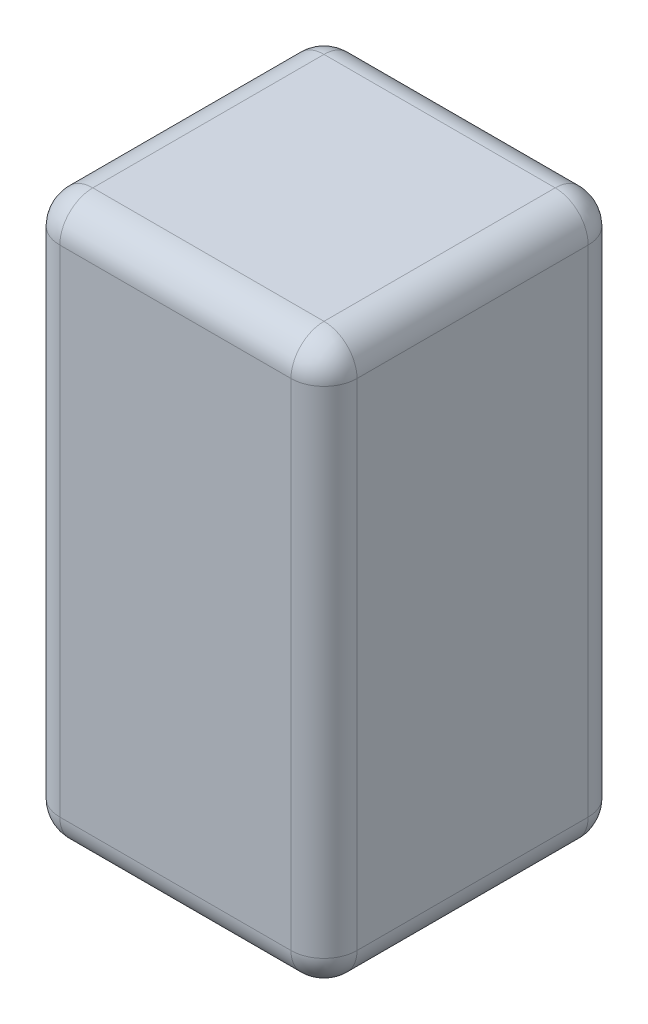
ISO-10303-21;
HEADER;
FILE_DESCRIPTION(('STEP AP214'),'2;1');
FILE_NAME('part.step','',(''),(''),'','','');
FILE_SCHEMA(('AUTOMOTIVE_DESIGN { 1 0 10303 214 1 1 1 1 }'));
ENDSEC;
DATA;
#1=APPLICATION_CONTEXT('core data for automotive mechanical design processes');
#2=APPLICATION_PROTOCOL_DEFINITION('international standard','automotive_design',2000,#1);
#3=PRODUCT_CONTEXT('',#1,'mechanical');
#4=PRODUCT('Part','Part','',(#3));
#5=PRODUCT_RELATED_PRODUCT_CATEGORY('part','',(#4));
#6=PRODUCT_DEFINITION_FORMATION('','',#4);
#7=PRODUCT_DEFINITION_CONTEXT('part definition',#1,'design');
#8=PRODUCT_DEFINITION('design','',#6,#7);
#9=PRODUCT_DEFINITION_SHAPE('','',#8);
#10=(LENGTH_UNIT() NAMED_UNIT(*) SI_UNIT(.MILLI.,.METRE.));
#11=(NAMED_UNIT(*) PLANE_ANGLE_UNIT() SI_UNIT($,.RADIAN.));
#12=(NAMED_UNIT(*) SI_UNIT($,.STERADIAN.) SOLID_ANGLE_UNIT());
#13=UNCERTAINTY_MEASURE_WITH_UNIT(LENGTH_MEASURE(1.E-05),#10,'distance_accuracy_value','');
#14=(GEOMETRIC_REPRESENTATION_CONTEXT(3) GLOBAL_UNCERTAINTY_ASSIGNED_CONTEXT((#13)) GLOBAL_UNIT_ASSIGNED_CONTEXT((#10,
#11,#12)) REPRESENTATION_CONTEXT('',''));
#15=CARTESIAN_POINT('',(0.,0.,0.));
#16=DIRECTION('',(0.,0.,1.));
#17=DIRECTION('',(1.,0.,0.));
#18=AXIS2_PLACEMENT_3D('',#15,#16,#17);
#19=CARTESIAN_POINT('',(-14.85,-8.85,-0.8));
#20=DIRECTION('',(-1.,0.,0.));
#21=DIRECTION('',(0.,1.,0.));
#22=AXIS2_PLACEMENT_3D('',#19,#20,#21);
#23=SPHERICAL_SURFACE('',#22,0.1);
#24=CARTESIAN_POINT('',(-14.85,-8.85,-0.8));
#25=DIRECTION('',(0.,-1.,0.));
#26=DIRECTION('',(1.,0.,0.));
#27=AXIS2_PLACEMENT_3D('',#24,#25,#26);
#28=CIRCLE('',#27,0.1);
#29=CARTESIAN_POINT('',(-14.95,-8.85,-0.8));
#30=VERTEX_POINT('',#29);
#31=CARTESIAN_POINT('',(-14.85,-8.85,-0.9));
#32=VERTEX_POINT('',#31);
#33=EDGE_CURVE('E120',#30,#32,#28,.T.);
#34=ORIENTED_EDGE('',*,*,#33,.F.);
#35=CARTESIAN_POINT('',(-14.85,-8.85,-0.8));
#36=DIRECTION('',(0.,0.,-1.));
#37=DIRECTION('',(-1.,0.,0.));
#38=AXIS2_PLACEMENT_3D('',#35,#36,#37);
#39=CIRCLE('',#38,0.1);
#40=CARTESIAN_POINT('',(-14.85,-8.75,-0.8));
#41=VERTEX_POINT('',#40);
#42=EDGE_CURVE('E122',#41,#30,#39,.F.);
#43=ORIENTED_EDGE('',*,*,#42,.F.);
#44=CARTESIAN_POINT('',(-14.85,-8.85,-0.8));
#45=DIRECTION('',(-1.,0.,0.));
#46=DIRECTION('',(0.,-1.,0.));
#47=AXIS2_PLACEMENT_3D('',#44,#45,#46);
#48=CIRCLE('',#47,0.1);
#49=EDGE_CURVE('E119',#32,#41,#48,.F.);
#50=ORIENTED_EDGE('',*,*,#49,.F.);
#51=EDGE_LOOP('',(#34,#43,#50));
#52=FACE_BOUND('',#51,.T.);
#53=ADVANCED_FACE('F17',(#52),#23,.T.);
#54=CARTESIAN_POINT('',(-14.85,-8.85,-0.1));
#55=DIRECTION('',(0.,1.,0.));
#56=DIRECTION('',(-1.,0.,0.));
#57=AXIS2_PLACEMENT_3D('',#54,#55,#56);
#58=SPHERICAL_SURFACE('',#57,0.1);
#59=CARTESIAN_POINT('',(-14.85,-8.85,-0.1));
#60=DIRECTION('',(0.,1.,0.));
#61=DIRECTION('',(-1.,0.,0.));
#62=AXIS2_PLACEMENT_3D('',#59,#60,#61);
#63=CIRCLE('',#62,0.1);
#64=CARTESIAN_POINT('',(-14.85,-8.85,0.));
#65=VERTEX_POINT('',#64);
#66=CARTESIAN_POINT('',(-14.95,-8.85,-0.1));
#67=VERTEX_POINT('',#66);
#68=EDGE_CURVE('E177',#65,#67,#63,.F.);
#69=ORIENTED_EDGE('',*,*,#68,.F.);
#70=CARTESIAN_POINT('',(-14.85,-8.85,-0.1));
#71=DIRECTION('',(-1.,0.,0.));
#72=DIRECTION('',(0.,-1.,0.));
#73=AXIS2_PLACEMENT_3D('',#70,#71,#72);
#74=CIRCLE('',#73,0.1);
#75=CARTESIAN_POINT('',(-14.85,-8.75,-0.1));
#76=VERTEX_POINT('',#75);
#77=EDGE_CURVE('E182',#76,#65,#74,.F.);
#78=ORIENTED_EDGE('',*,*,#77,.F.);
#79=CARTESIAN_POINT('',(-14.85,-8.85,-0.1));
#80=DIRECTION('',(0.,0.,-1.));
#81=DIRECTION('',(-1.,0.,0.));
#82=AXIS2_PLACEMENT_3D('',#79,#80,#81);
#83=CIRCLE('',#82,0.1);
#84=EDGE_CURVE('E187',#67,#76,#83,.T.);
#85=ORIENTED_EDGE('',*,*,#84,.F.);
#86=EDGE_LOOP('',(#69,#78,#85));
#87=FACE_BOUND('',#86,.T.);
#88=ADVANCED_FACE('F221',(#87),#58,.T.);
#89=CARTESIAN_POINT('',(-14.85,-10.35,-0.1));
#90=DIRECTION('',(-1.,0.,0.));
#91=DIRECTION('',(0.,-1.,0.));
#92=AXIS2_PLACEMENT_3D('',#89,#90,#91);
#93=SPHERICAL_SURFACE('',#92,0.1);
#94=CARTESIAN_POINT('',(-14.85,-10.35,-0.1));
#95=DIRECTION('',(0.,0.,1.));
#96=DIRECTION('',(0.,-1.,0.));
#97=AXIS2_PLACEMENT_3D('',#94,#95,#96);
#98=CIRCLE('',#97,0.1);
#99=CARTESIAN_POINT('',(-14.85,-10.45,-0.1));
#100=VERTEX_POINT('',#99);
#101=CARTESIAN_POINT('',(-14.95,-10.35,-0.0999999999999999));
#102=VERTEX_POINT('',#101);
#103=EDGE_CURVE('E166',#100,#102,#98,.F.);
#104=ORIENTED_EDGE('',*,*,#103,.F.);
#105=CARTESIAN_POINT('',(-14.85,-10.35,-0.1));
#106=DIRECTION('',(-1.,0.,0.));
#107=DIRECTION('',(0.,-1.,0.));
#108=AXIS2_PLACEMENT_3D('',#105,#106,#107);
#109=CIRCLE('',#108,0.1);
#110=CARTESIAN_POINT('',(-14.85,-10.35,0.));
#111=VERTEX_POINT('',#110);
#112=EDGE_CURVE('E152',#111,#100,#109,.F.);
#113=ORIENTED_EDGE('',*,*,#112,.F.);
#114=CARTESIAN_POINT('',(-14.85,-10.35,-0.0999999999999999));
#115=DIRECTION('',(0.,1.,0.));
#116=DIRECTION('',(-1.,0.,0.));
#117=AXIS2_PLACEMENT_3D('',#114,#115,#116);
#118=CIRCLE('',#117,0.1);
#119=EDGE_CURVE('E156',#102,#111,#118,.T.);
#120=ORIENTED_EDGE('',*,*,#119,.F.);
#121=EDGE_LOOP('',(#104,#113,#120));
#122=FACE_BOUND('',#121,.T.);
#123=ADVANCED_FACE('F216',(#122),#93,.T.);
#124=CARTESIAN_POINT('',(-14.85,-10.35,-0.8));
#125=DIRECTION('',(0.,-1.,0.));
#126=DIRECTION('',(-1.,0.,0.));
#127=AXIS2_PLACEMENT_3D('',#124,#125,#126);
#128=SPHERICAL_SURFACE('',#127,0.1);
#129=CARTESIAN_POINT('',(-14.85,-10.35,-0.8));
#130=DIRECTION('',(0.,0.,1.));
#131=DIRECTION('',(0.,-1.,0.));
#132=AXIS2_PLACEMENT_3D('',#129,#130,#131);
#133=CIRCLE('',#132,0.1);
#134=CARTESIAN_POINT('',(-14.95,-10.35,-0.8));
#135=VERTEX_POINT('',#134);
#136=CARTESIAN_POINT('',(-14.85,-10.45,-0.8));
#137=VERTEX_POINT('',#136);
#138=EDGE_CURVE('E155',#135,#137,#133,.T.);
#139=ORIENTED_EDGE('',*,*,#138,.F.);
#140=CARTESIAN_POINT('',(-14.85,-10.35,-0.8));
#141=DIRECTION('',(0.,-1.,0.));
#142=DIRECTION('',(1.,0.,0.));
#143=AXIS2_PLACEMENT_3D('',#140,#141,#142);
#144=CIRCLE('',#143,0.1);
#145=CARTESIAN_POINT('',(-14.85,-10.35,-0.9));
#146=VERTEX_POINT('',#145);
#147=EDGE_CURVE('E137',#146,#135,#144,.F.);
#148=ORIENTED_EDGE('',*,*,#147,.F.);
#149=CARTESIAN_POINT('',(-14.85,-10.35,-0.8));
#150=DIRECTION('',(-1.,0.,0.));
#151=DIRECTION('',(0.,-1.,0.));
#152=AXIS2_PLACEMENT_3D('',#149,#150,#151);
#153=CIRCLE('',#152,0.1);
#154=EDGE_CURVE('E144',#137,#146,#153,.F.);
#155=ORIENTED_EDGE('',*,*,#154,.F.);
#156=EDGE_LOOP('',(#139,#148,#155));
#157=FACE_BOUND('',#156,.T.);
#158=ADVANCED_FACE('F212',(#157),#128,.T.);
#159=CARTESIAN_POINT('',(-15.25,-8.85,-0.8));
#160=DIRECTION('',(-1.,0.,0.));
#161=DIRECTION('',(0.,-1.,0.));
#162=AXIS2_PLACEMENT_3D('',#159,#160,#161);
#163=CYLINDRICAL_SURFACE('',#162,0.1);
#164=DIRECTION('',(-1.,0.,0.));
#165=VECTOR('',#164,1.);
#166=CARTESIAN_POINT('',(-14.95,-8.75,-0.8));
#167=LINE('',#166,#165);
#168=CARTESIAN_POINT('',(-14.15,-8.75,-0.8));
#169=VERTEX_POINT('',#168);
#170=EDGE_CURVE('E135',#169,#41,#167,.T.);
#171=ORIENTED_EDGE('',*,*,#170,.F.);
#172=CARTESIAN_POINT('',(-14.15,-8.85,-0.8));
#173=DIRECTION('',(-1.,0.,0.));
#174=DIRECTION('',(0.,1.,0.));
#175=AXIS2_PLACEMENT_3D('',#172,#173,#174);
#176=CIRCLE('',#175,0.1);
#177=CARTESIAN_POINT('',(-14.15,-8.85,-0.9));
#178=VERTEX_POINT('',#177);
#179=EDGE_CURVE('E133',#178,#169,#176,.F.);
#180=ORIENTED_EDGE('',*,*,#179,.F.);
#181=DIRECTION('',(-1.,0.,0.));
#182=VECTOR('',#181,1.);
#183=CARTESIAN_POINT('',(-14.95,-8.85,-0.9));
#184=LINE('',#183,#182);
#185=EDGE_CURVE('E106',#32,#178,#184,.F.);
#186=ORIENTED_EDGE('',*,*,#185,.F.);
#187=ORIENTED_EDGE('',*,*,#49,.T.);
#188=EDGE_LOOP('',(#171,#180,#186,#187));
#189=FACE_BOUND('',#188,.T.);
#190=ADVANCED_FACE('F131',(#189),#163,.T.);
#191=CARTESIAN_POINT('',(-14.85,-8.85,-1.3));
#192=DIRECTION('',(0.,0.,-1.));
#193=DIRECTION('',(-1.,0.,0.));
#194=AXIS2_PLACEMENT_3D('',#191,#192,#193);
#195=CYLINDRICAL_SURFACE('',#194,0.1);
#196=ORIENTED_EDGE('',*,*,#84,.T.);
#197=DIRECTION('',(0.,0.,1.));
#198=VECTOR('',#197,1.);
#199=CARTESIAN_POINT('',(-14.85,-8.75,-0.9));
#200=LINE('',#199,#198);
#201=EDGE_CURVE('E190',#41,#76,#200,.T.);
#202=ORIENTED_EDGE('',*,*,#201,.F.);
#203=ORIENTED_EDGE('',*,*,#42,.T.);
#204=DIRECTION('',(0.,0.,-1.));
#205=VECTOR('',#204,1.);
#206=CARTESIAN_POINT('',(-14.95,-8.85,-1.3));
#207=LINE('',#206,#205);
#208=EDGE_CURVE('E198',#30,#67,#207,.F.);
#209=ORIENTED_EDGE('',*,*,#208,.T.);
#210=EDGE_LOOP('',(#196,#202,#203,#209));
#211=FACE_BOUND('',#210,.T.);
#212=ADVANCED_FACE('F323',(#211),#195,.T.);
#213=CARTESIAN_POINT('',(-14.95,-9.6,0.));
#214=DIRECTION('',(1.,0.,0.));
#215=DIRECTION('',(0.,1.,0.));
#216=AXIS2_PLACEMENT_3D('',#213,#214,#215);
#217=PLANE('',#216);
#218=DIRECTION('',(0.,0.,1.));
#219=VECTOR('',#218,1.);
#220=CARTESIAN_POINT('',(-14.95,-10.35,0.4));
#221=LINE('',#220,#219);
#222=EDGE_CURVE('E149',#102,#135,#221,.F.);
#223=ORIENTED_EDGE('',*,*,#222,.F.);
#224=DIRECTION('',(0.,1.,0.));
#225=VECTOR('',#224,1.);
#226=CARTESIAN_POINT('',(-14.95,-8.45,-0.1));
#227=LINE('',#226,#225);
#228=EDGE_CURVE('E257',#67,#102,#227,.F.);
#229=ORIENTED_EDGE('',*,*,#228,.F.);
#230=ORIENTED_EDGE('',*,*,#208,.F.);
#231=DIRECTION('',(0.,-1.,0.));
#232=VECTOR('',#231,1.);
#233=CARTESIAN_POINT('',(-14.95,-10.75,-0.8));
#234=LINE('',#233,#232);
#235=EDGE_CURVE('E128',#135,#30,#234,.F.);
#236=ORIENTED_EDGE('',*,*,#235,.F.);
#237=EDGE_LOOP('',(#223,#229,#230,#236));
#238=FACE_BOUND('',#237,.T.);
#239=ADVANCED_FACE('F320',(#238),#217,.F.);
#240=CARTESIAN_POINT('',(-15.25,-8.85,-0.1));
#241=DIRECTION('',(-1.,0.,0.));
#242=DIRECTION('',(0.,-1.,0.));
#243=AXIS2_PLACEMENT_3D('',#240,#241,#242);
#244=CYLINDRICAL_SURFACE('',#243,0.1);
#245=DIRECTION('',(1.,0.,0.));
#246=VECTOR('',#245,1.);
#247=CARTESIAN_POINT('',(-14.95,-8.85,0.));
#248=LINE('',#247,#246);
#249=CARTESIAN_POINT('',(-14.15,-8.85,0.));
#250=VERTEX_POINT('',#249);
#251=EDGE_CURVE('E259',#250,#65,#248,.F.);
#252=ORIENTED_EDGE('',*,*,#251,.F.);
#253=CARTESIAN_POINT('',(-14.15,-8.85,-0.1));
#254=DIRECTION('',(1.,0.,0.));
#255=DIRECTION('',(0.,1.,0.));
#256=AXIS2_PLACEMENT_3D('',#253,#254,#255);
#257=CIRCLE('',#256,0.0999999999999994);
#258=CARTESIAN_POINT('',(-14.15,-8.75,-0.1));
#259=VERTEX_POINT('',#258);
#260=EDGE_CURVE('E260',#259,#250,#257,.T.);
#261=ORIENTED_EDGE('',*,*,#260,.F.);
#262=DIRECTION('',(-1.,0.,0.));
#263=VECTOR('',#262,1.);
#264=CARTESIAN_POINT('',(-14.95,-8.75,-0.1));
#265=LINE('',#264,#263);
#266=EDGE_CURVE('E193',#76,#259,#265,.F.);
#267=ORIENTED_EDGE('',*,*,#266,.F.);
#268=ORIENTED_EDGE('',*,*,#77,.T.);
#269=EDGE_LOOP('',(#252,#261,#267,#268));
#270=FACE_BOUND('',#269,.T.);
#271=ADVANCED_FACE('F316',(#270),#244,.T.);
#272=CARTESIAN_POINT('',(-15.25,-10.35,-0.1));
#273=DIRECTION('',(-1.,0.,0.));
#274=DIRECTION('',(0.,-1.,0.));
#275=AXIS2_PLACEMENT_3D('',#272,#273,#274);
#276=CYLINDRICAL_SURFACE('',#275,0.1);
#277=DIRECTION('',(1.,0.,0.));
#278=VECTOR('',#277,1.);
#279=CARTESIAN_POINT('',(-14.95,-10.45,-0.1));
#280=LINE('',#279,#278);
#281=CARTESIAN_POINT('',(-14.15,-10.45,-0.1));
#282=VERTEX_POINT('',#281);
#283=EDGE_CURVE('E163',#282,#100,#280,.F.);
#284=ORIENTED_EDGE('',*,*,#283,.F.);
#285=CARTESIAN_POINT('',(-14.15,-10.35,-0.0999999999999994));
#286=DIRECTION('',(-1.,0.,0.));
#287=DIRECTION('',(0.,-1.,0.));
#288=AXIS2_PLACEMENT_3D('',#285,#286,#287);
#289=CIRCLE('',#288,0.1);
#290=CARTESIAN_POINT('',(-14.15,-10.35,0.));
#291=VERTEX_POINT('',#290);
#292=EDGE_CURVE('E378',#291,#282,#289,.F.);
#293=ORIENTED_EDGE('',*,*,#292,.F.);
#294=DIRECTION('',(1.,0.,0.));
#295=VECTOR('',#294,1.);
#296=CARTESIAN_POINT('',(-14.95,-10.35,0.));
#297=LINE('',#296,#295);
#298=EDGE_CURVE('E265',#111,#291,#297,.T.);
#299=ORIENTED_EDGE('',*,*,#298,.F.);
#300=ORIENTED_EDGE('',*,*,#112,.T.);
#301=EDGE_LOOP('',(#284,#293,#299,#300));
#302=FACE_BOUND('',#301,.T.);
#303=ADVANCED_FACE('F312',(#302),#276,.T.);
#304=CARTESIAN_POINT('',(-14.85,-10.35,0.4));
#305=DIRECTION('',(0.,0.,1.));
#306=DIRECTION('',(0.,-1.,0.));
#307=AXIS2_PLACEMENT_3D('',#304,#305,#306);
#308=CYLINDRICAL_SURFACE('',#307,0.1);
#309=ORIENTED_EDGE('',*,*,#103,.T.);
#310=ORIENTED_EDGE('',*,*,#222,.T.);
#311=ORIENTED_EDGE('',*,*,#138,.T.);
#312=DIRECTION('',(0.,0.,1.));
#313=VECTOR('',#312,1.);
#314=CARTESIAN_POINT('',(-14.85,-10.45,0.));
#315=LINE('',#314,#313);
#316=EDGE_CURVE('E159',#100,#137,#315,.F.);
#317=ORIENTED_EDGE('',*,*,#316,.F.);
#318=EDGE_LOOP('',(#309,#310,#311,#317));
#319=FACE_BOUND('',#318,.T.);
#320=ADVANCED_FACE('F308',(#319),#308,.T.);
#321=CARTESIAN_POINT('',(-15.25,-10.35,-0.8));
#322=DIRECTION('',(-1.,0.,0.));
#323=DIRECTION('',(0.,-1.,0.));
#324=AXIS2_PLACEMENT_3D('',#321,#322,#323);
#325=CYLINDRICAL_SURFACE('',#324,0.1);
#326=DIRECTION('',(-1.,0.,0.));
#327=VECTOR('',#326,1.);
#328=CARTESIAN_POINT('',(-14.95,-10.35,-0.9));
#329=LINE('',#328,#327);
#330=CARTESIAN_POINT('',(-14.15,-10.35,-0.9));
#331=VERTEX_POINT('',#330);
#332=EDGE_CURVE('E109',#331,#146,#329,.T.);
#333=ORIENTED_EDGE('',*,*,#332,.F.);
#334=CARTESIAN_POINT('',(-14.15,-10.35,-0.8));
#335=DIRECTION('',(1.,0.,0.));
#336=DIRECTION('',(0.,-1.,0.));
#337=AXIS2_PLACEMENT_3D('',#334,#335,#336);
#338=CIRCLE('',#337,0.0999999999999994);
#339=CARTESIAN_POINT('',(-14.15,-10.45,-0.8));
#340=VERTEX_POINT('',#339);
#341=EDGE_CURVE('E162',#340,#331,#338,.T.);
#342=ORIENTED_EDGE('',*,*,#341,.F.);
#343=DIRECTION('',(1.,0.,0.));
#344=VECTOR('',#343,1.);
#345=CARTESIAN_POINT('',(-14.95,-10.45,-0.8));
#346=LINE('',#345,#344);
#347=EDGE_CURVE('E426',#137,#340,#346,.T.);
#348=ORIENTED_EDGE('',*,*,#347,.F.);
#349=ORIENTED_EDGE('',*,*,#154,.T.);
#350=EDGE_LOOP('',(#333,#342,#348,#349));
#351=FACE_BOUND('',#350,.T.);
#352=ADVANCED_FACE('F305',(#351),#325,.T.);
#353=CARTESIAN_POINT('',(-14.85,-10.75,-0.8));
#354=DIRECTION('',(0.,-1.,0.));
#355=DIRECTION('',(1.,0.,0.));
#356=AXIS2_PLACEMENT_3D('',#353,#354,#355);
#357=CYLINDRICAL_SURFACE('',#356,0.1);
#358=ORIENTED_EDGE('',*,*,#235,.T.);
#359=ORIENTED_EDGE('',*,*,#33,.T.);
#360=DIRECTION('',(0.,1.,0.));
#361=VECTOR('',#360,1.);
#362=CARTESIAN_POINT('',(-14.85,-10.45,-0.9));
#363=LINE('',#362,#361);
#364=EDGE_CURVE('E102',#146,#32,#363,.T.);
#365=ORIENTED_EDGE('',*,*,#364,.F.);
#366=ORIENTED_EDGE('',*,*,#147,.T.);
#367=EDGE_LOOP('',(#358,#359,#365,#366));
#368=FACE_BOUND('',#367,.T.);
#369=ADVANCED_FACE('F127',(#368),#357,.T.);
#370=CARTESIAN_POINT('',(-14.15,-8.85,-0.8));
#371=DIRECTION('',(0.,1.,0.));
#372=DIRECTION('',(1.,0.,0.));
#373=AXIS2_PLACEMENT_3D('',#370,#371,#372);
#374=SPHERICAL_SURFACE('',#373,0.1);
#375=CARTESIAN_POINT('',(-14.15,-8.85,-0.8));
#376=DIRECTION('',(0.,1.,0.));
#377=DIRECTION('',(-1.,0.,0.));
#378=AXIS2_PLACEMENT_3D('',#375,#376,#377);
#379=CIRCLE('',#378,0.1);
#380=CARTESIAN_POINT('',(-14.05,-8.85,-0.8));
#381=VERTEX_POINT('',#380);
#382=EDGE_CURVE('E114',#178,#381,#379,.F.);
#383=ORIENTED_EDGE('',*,*,#382,.F.);
#384=ORIENTED_EDGE('',*,*,#179,.T.);
#385=CARTESIAN_POINT('',(-14.15,-8.85,-0.8));
#386=DIRECTION('',(0.,0.,1.));
#387=DIRECTION('',(1.,0.,0.));
#388=AXIS2_PLACEMENT_3D('',#385,#386,#387);
#389=CIRCLE('',#388,0.1);
#390=EDGE_CURVE('E285',#381,#169,#389,.T.);
#391=ORIENTED_EDGE('',*,*,#390,.F.);
#392=EDGE_LOOP('',(#383,#384,#391));
#393=FACE_BOUND('',#392,.T.);
#394=ADVANCED_FACE('F296',(#393),#374,.T.);
#395=CARTESIAN_POINT('',(-14.95,-8.75,-0.9));
#396=DIRECTION('',(0.,1.,0.));
#397=DIRECTION('',(-1.,0.,0.));
#398=AXIS2_PLACEMENT_3D('',#395,#396,#397);
#399=PLANE('',#398);
#400=ORIENTED_EDGE('',*,*,#266,.T.);
#401=DIRECTION('',(0.,0.,1.));
#402=VECTOR('',#401,1.);
#403=CARTESIAN_POINT('',(-14.15,-8.75,-1.3));
#404=LINE('',#403,#402);
#405=EDGE_CURVE('E281',#169,#259,#404,.T.);
#406=ORIENTED_EDGE('',*,*,#405,.F.);
#407=ORIENTED_EDGE('',*,*,#170,.T.);
#408=ORIENTED_EDGE('',*,*,#201,.T.);
#409=EDGE_LOOP('',(#400,#406,#407,#408));
#410=FACE_BOUND('',#409,.T.);
#411=ADVANCED_FACE('F300',(#410),#399,.T.);
#412=CARTESIAN_POINT('',(-14.15,-8.85,-0.1));
#413=DIRECTION('',(1.,0.,0.));
#414=DIRECTION('',(0.,1.,0.));
#415=AXIS2_PLACEMENT_3D('',#412,#413,#414);
#416=SPHERICAL_SURFACE('',#415,0.1);
#417=CARTESIAN_POINT('',(-14.15,-8.85,-0.1));
#418=DIRECTION('',(0.,-1.,0.));
#419=DIRECTION('',(1.,0.,0.));
#420=AXIS2_PLACEMENT_3D('',#417,#418,#419);
#421=CIRCLE('',#420,0.1);
#422=CARTESIAN_POINT('',(-14.05,-8.85,-0.1));
#423=VERTEX_POINT('',#422);
#424=EDGE_CURVE('E252',#423,#250,#421,.T.);
#425=ORIENTED_EDGE('',*,*,#424,.F.);
#426=CARTESIAN_POINT('',(-14.15,-8.85,-0.1));
#427=DIRECTION('',(0.,0.,1.));
#428=DIRECTION('',(1.,0.,0.));
#429=AXIS2_PLACEMENT_3D('',#426,#427,#428);
#430=CIRCLE('',#429,0.1);
#431=EDGE_CURVE('E284',#259,#423,#430,.F.);
#432=ORIENTED_EDGE('',*,*,#431,.F.);
#433=ORIENTED_EDGE('',*,*,#260,.T.);
#434=EDGE_LOOP('',(#425,#432,#433));
#435=FACE_BOUND('',#434,.T.);
#436=ADVANCED_FACE('F386',(#435),#416,.T.);
#437=CARTESIAN_POINT('',(-14.85,-8.45,-0.1));
#438=DIRECTION('',(0.,1.,0.));
#439=DIRECTION('',(-1.,0.,0.));
#440=AXIS2_PLACEMENT_3D('',#437,#438,#439);
#441=CYLINDRICAL_SURFACE('',#440,0.1);
#442=DIRECTION('',(0.,-1.,0.));
#443=VECTOR('',#442,1.);
#444=CARTESIAN_POINT('',(-14.85,-8.75,0.));
#445=LINE('',#444,#443);
#446=EDGE_CURVE('E249',#65,#111,#445,.T.);
#447=ORIENTED_EDGE('',*,*,#446,.F.);
#448=ORIENTED_EDGE('',*,*,#68,.T.);
#449=ORIENTED_EDGE('',*,*,#228,.T.);
#450=ORIENTED_EDGE('',*,*,#119,.T.);
#451=EDGE_LOOP('',(#447,#448,#449,#450));
#452=FACE_BOUND('',#451,.T.);
#453=ADVANCED_FACE('F383',(#452),#441,.T.);
#454=CARTESIAN_POINT('',(-14.15,-10.35,-0.1));
#455=DIRECTION('',(0.,-1.,0.));
#456=DIRECTION('',(1.,0.,0.));
#457=AXIS2_PLACEMENT_3D('',#454,#455,#456);
#458=SPHERICAL_SURFACE('',#457,0.1);
#459=ORIENTED_EDGE('',*,*,#292,.T.);
#460=CARTESIAN_POINT('',(-14.15,-10.35,-0.1));
#461=DIRECTION('',(0.,0.,-1.));
#462=DIRECTION('',(0.,1.,0.));
#463=AXIS2_PLACEMENT_3D('',#460,#461,#462);
#464=CIRCLE('',#463,0.1);
#465=CARTESIAN_POINT('',(-14.05,-10.35,-0.1));
#466=VERTEX_POINT('',#465);
#467=EDGE_CURVE('E443',#466,#282,#464,.T.);
#468=ORIENTED_EDGE('',*,*,#467,.F.);
#469=CARTESIAN_POINT('',(-14.15,-10.35,-0.0999999999999999));
#470=DIRECTION('',(0.,-1.,0.));
#471=DIRECTION('',(1.,0.,0.));
#472=AXIS2_PLACEMENT_3D('',#469,#470,#471);
#473=CIRCLE('',#472,0.1);
#474=EDGE_CURVE('E251',#291,#466,#473,.F.);
#475=ORIENTED_EDGE('',*,*,#474,.F.);
#476=EDGE_LOOP('',(#459,#468,#475));
#477=FACE_BOUND('',#476,.T.);
#478=ADVANCED_FACE('F380',(#477),#458,.T.);
#479=CARTESIAN_POINT('',(-14.95,-10.45,0.));
#480=DIRECTION('',(0.,-1.,0.));
#481=DIRECTION('',(1.,0.,0.));
#482=AXIS2_PLACEMENT_3D('',#479,#480,#481);
#483=PLANE('',#482);
#484=ORIENTED_EDGE('',*,*,#283,.T.);
#485=ORIENTED_EDGE('',*,*,#316,.T.);
#486=ORIENTED_EDGE('',*,*,#347,.T.);
#487=DIRECTION('',(0.,0.,-1.));
#488=VECTOR('',#487,1.);
#489=CARTESIAN_POINT('',(-14.15,-10.45,0.4));
#490=LINE('',#489,#488);
#491=EDGE_CURVE('E441',#282,#340,#490,.T.);
#492=ORIENTED_EDGE('',*,*,#491,.F.);
#493=EDGE_LOOP('',(#484,#485,#486,#492));
#494=FACE_BOUND('',#493,.T.);
#495=ADVANCED_FACE('F364',(#494),#483,.T.);
#496=CARTESIAN_POINT('',(-14.15,-10.35,-0.8));
#497=DIRECTION('',(1.,0.,0.));
#498=DIRECTION('',(0.,-1.,0.));
#499=AXIS2_PLACEMENT_3D('',#496,#497,#498);
#500=SPHERICAL_SURFACE('',#499,0.1);
#501=ORIENTED_EDGE('',*,*,#341,.T.);
#502=CARTESIAN_POINT('',(-14.15,-10.35,-0.8));
#503=DIRECTION('',(0.,1.,0.));
#504=DIRECTION('',(-1.,0.,0.));
#505=AXIS2_PLACEMENT_3D('',#502,#503,#504);
#506=CIRCLE('',#505,0.1);
#507=CARTESIAN_POINT('',(-14.05,-10.35,-0.8));
#508=VERTEX_POINT('',#507);
#509=EDGE_CURVE('E246',#508,#331,#506,.T.);
#510=ORIENTED_EDGE('',*,*,#509,.F.);
#511=CARTESIAN_POINT('',(-14.15,-10.35,-0.8));
#512=DIRECTION('',(0.,0.,-1.));
#513=DIRECTION('',(0.,1.,0.));
#514=AXIS2_PLACEMENT_3D('',#511,#512,#513);
#515=CIRCLE('',#514,0.1);
#516=EDGE_CURVE('E448',#340,#508,#515,.F.);
#517=ORIENTED_EDGE('',*,*,#516,.F.);
#518=EDGE_LOOP('',(#501,#510,#517));
#519=FACE_BOUND('',#518,.T.);
#520=ADVANCED_FACE('F360',(#519),#500,.T.);
#521=CARTESIAN_POINT('',(-14.95,-10.45,-0.9));
#522=DIRECTION('',(0.,0.,-1.));
#523=DIRECTION('',(-1.,0.,0.));
#524=AXIS2_PLACEMENT_3D('',#521,#522,#523);
#525=PLANE('',#524);
#526=DIRECTION('',(0.,1.,0.));
#527=VECTOR('',#526,1.);
#528=CARTESIAN_POINT('',(-14.15,-10.75,-0.9));
#529=LINE('',#528,#527);
#530=EDGE_CURVE('E244',#331,#178,#529,.T.);
#531=ORIENTED_EDGE('',*,*,#530,.F.);
#532=ORIENTED_EDGE('',*,*,#332,.T.);
#533=ORIENTED_EDGE('',*,*,#364,.T.);
#534=ORIENTED_EDGE('',*,*,#185,.T.);
#535=EDGE_LOOP('',(#531,#532,#533,#534));
#536=FACE_BOUND('',#535,.T.);
#537=ADVANCED_FACE('F104',(#536),#525,.T.);
#538=CARTESIAN_POINT('',(-14.15,-8.85,-1.3));
#539=DIRECTION('',(0.,0.,1.));
#540=DIRECTION('',(1.,0.,0.));
#541=AXIS2_PLACEMENT_3D('',#538,#539,#540);
#542=CYLINDRICAL_SURFACE('',#541,0.1);
#543=ORIENTED_EDGE('',*,*,#431,.T.);
#544=DIRECTION('',(0.,0.,1.));
#545=VECTOR('',#544,1.);
#546=CARTESIAN_POINT('',(-14.05,-8.85,0.));
#547=LINE('',#546,#545);
#548=EDGE_CURVE('E241',#381,#423,#547,.T.);
#549=ORIENTED_EDGE('',*,*,#548,.F.);
#550=ORIENTED_EDGE('',*,*,#390,.T.);
#551=ORIENTED_EDGE('',*,*,#405,.T.);
#552=EDGE_LOOP('',(#543,#549,#550,#551));
#553=FACE_BOUND('',#552,.T.);
#554=ADVANCED_FACE('F353',(#553),#542,.T.);
#555=CARTESIAN_POINT('',(-14.95,-8.75,0.));
#556=DIRECTION('',(0.,0.,1.));
#557=DIRECTION('',(0.,-1.,0.));
#558=AXIS2_PLACEMENT_3D('',#555,#556,#557);
#559=PLANE('',#558);
#560=ORIENTED_EDGE('',*,*,#251,.T.);
#561=ORIENTED_EDGE('',*,*,#446,.T.);
#562=ORIENTED_EDGE('',*,*,#298,.T.);
#563=DIRECTION('',(0.,-1.,0.));
#564=VECTOR('',#563,1.);
#565=CARTESIAN_POINT('',(-14.15,-8.45,0.));
#566=LINE('',#565,#564);
#567=EDGE_CURVE('E239',#250,#291,#566,.T.);
#568=ORIENTED_EDGE('',*,*,#567,.F.);
#569=EDGE_LOOP('',(#560,#561,#562,#568));
#570=FACE_BOUND('',#569,.T.);
#571=ADVANCED_FACE('F349',(#570),#559,.T.);
#572=CARTESIAN_POINT('',(-14.15,-10.35,0.4));
#573=DIRECTION('',(0.,0.,-1.));
#574=DIRECTION('',(0.,1.,0.));
#575=AXIS2_PLACEMENT_3D('',#572,#573,#574);
#576=CYLINDRICAL_SURFACE('',#575,0.1);
#577=ORIENTED_EDGE('',*,*,#467,.T.);
#578=ORIENTED_EDGE('',*,*,#491,.T.);
#579=ORIENTED_EDGE('',*,*,#516,.T.);
#580=DIRECTION('',(0.,0.,1.));
#581=VECTOR('',#580,1.);
#582=CARTESIAN_POINT('',(-14.05,-10.35,0.));
#583=LINE('',#582,#581);
#584=EDGE_CURVE('E236',#466,#508,#583,.F.);
#585=ORIENTED_EDGE('',*,*,#584,.F.);
#586=EDGE_LOOP('',(#577,#578,#579,#585));
#587=FACE_BOUND('',#586,.T.);
#588=ADVANCED_FACE('F346',(#587),#576,.T.);
#589=CARTESIAN_POINT('',(-14.15,-10.75,-0.8));
#590=DIRECTION('',(0.,1.,0.));
#591=DIRECTION('',(-1.,0.,0.));
#592=AXIS2_PLACEMENT_3D('',#589,#590,#591);
#593=CYLINDRICAL_SURFACE('',#592,0.1);
#594=ORIENTED_EDGE('',*,*,#530,.T.);
#595=ORIENTED_EDGE('',*,*,#382,.T.);
#596=DIRECTION('',(0.,1.,0.));
#597=VECTOR('',#596,1.);
#598=CARTESIAN_POINT('',(-14.05,-9.6,-0.8));
#599=LINE('',#598,#597);
#600=EDGE_CURVE('E27',#508,#381,#599,.T.);
#601=ORIENTED_EDGE('',*,*,#600,.F.);
#602=ORIENTED_EDGE('',*,*,#509,.T.);
#603=EDGE_LOOP('',(#594,#595,#601,#602));
#604=FACE_BOUND('',#603,.T.);
#605=ADVANCED_FACE('F339',(#604),#593,.T.);
#606=CARTESIAN_POINT('',(-14.15,-8.45,-0.1));
#607=DIRECTION('',(0.,-1.,0.));
#608=DIRECTION('',(1.,0.,0.));
#609=AXIS2_PLACEMENT_3D('',#606,#607,#608);
#610=CYLINDRICAL_SURFACE('',#609,0.1);
#611=ORIENTED_EDGE('',*,*,#567,.T.);
#612=ORIENTED_EDGE('',*,*,#474,.T.);
#613=DIRECTION('',(0.,1.,0.));
#614=VECTOR('',#613,1.);
#615=CARTESIAN_POINT('',(-14.05,-9.6,-0.1));
#616=LINE('',#615,#614);
#617=EDGE_CURVE('E11',#423,#466,#616,.F.);
#618=ORIENTED_EDGE('',*,*,#617,.F.);
#619=ORIENTED_EDGE('',*,*,#424,.T.);
#620=EDGE_LOOP('',(#611,#612,#618,#619));
#621=FACE_BOUND('',#620,.T.);
#622=ADVANCED_FACE('F333',(#621),#610,.T.);
#623=CARTESIAN_POINT('',(-14.05,-9.6,0.));
#624=DIRECTION('',(1.,0.,0.));
#625=DIRECTION('',(0.,1.,0.));
#626=AXIS2_PLACEMENT_3D('',#623,#624,#625);
#627=PLANE('',#626);
#628=ORIENTED_EDGE('',*,*,#584,.T.);
#629=ORIENTED_EDGE('',*,*,#600,.T.);
#630=ORIENTED_EDGE('',*,*,#548,.T.);
#631=ORIENTED_EDGE('',*,*,#617,.T.);
#632=EDGE_LOOP('',(#628,#629,#630,#631));
#633=FACE_BOUND('',#632,.T.);
#634=ADVANCED_FACE('F331',(#633),#627,.T.);
#635=CLOSED_SHELL('',(#53,#88,#123,#158,#190,#212,#239,#271,#303,#320,#352,#369,#394,#411,#436,
#453,#478,#495,#520,#537,#554,#571,#588,#605,#622,#634));
#636=MANIFOLD_SOLID_BREP('B1',#635);
#637=ADVANCED_BREP_SHAPE_REPRESENTATION('',(#18,#636),#14);
#638=SHAPE_DEFINITION_REPRESENTATION(#9,#637);
ENDSEC;
END-ISO-10303-21;
